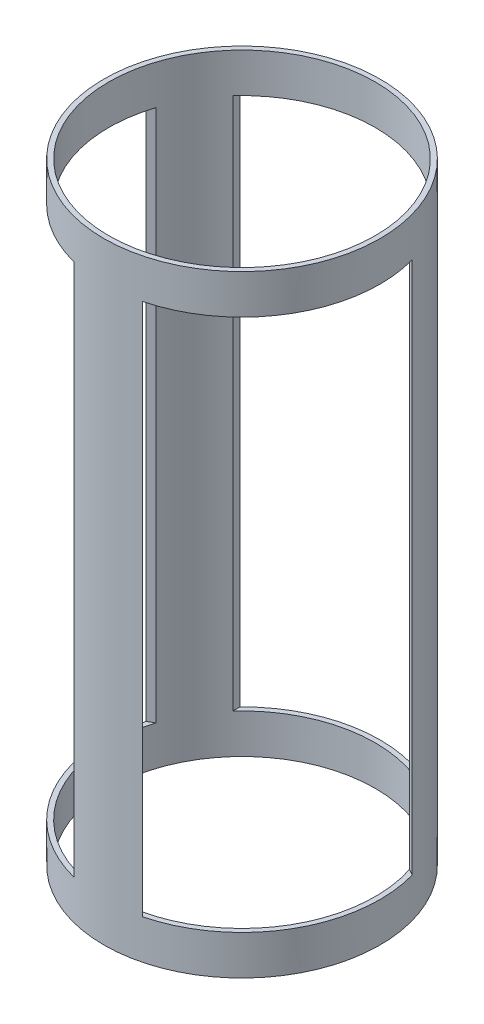
ISO-10303-21;
HEADER;
FILE_DESCRIPTION(('STEP AP214'),'2;1');
FILE_NAME('part.step','',(''),(''),'','','');
FILE_SCHEMA(('AUTOMOTIVE_DESIGN { 1 0 10303 214 1 1 1 1 }'));
ENDSEC;
DATA;
#1=APPLICATION_CONTEXT('core data for automotive mechanical design processes');
#2=APPLICATION_PROTOCOL_DEFINITION('international standard','automotive_design',2000,#1);
#3=PRODUCT_CONTEXT('',#1,'mechanical');
#4=PRODUCT('Part','Part','',(#3));
#5=PRODUCT_RELATED_PRODUCT_CATEGORY('part','',(#4));
#6=PRODUCT_DEFINITION_FORMATION('','',#4);
#7=PRODUCT_DEFINITION_CONTEXT('part definition',#1,'design');
#8=PRODUCT_DEFINITION('design','',#6,#7);
#9=PRODUCT_DEFINITION_SHAPE('','',#8);
#10=(LENGTH_UNIT() NAMED_UNIT(*) SI_UNIT(.MILLI.,.METRE.));
#11=(NAMED_UNIT(*) PLANE_ANGLE_UNIT() SI_UNIT($,.RADIAN.));
#12=(NAMED_UNIT(*) SI_UNIT($,.STERADIAN.) SOLID_ANGLE_UNIT());
#13=UNCERTAINTY_MEASURE_WITH_UNIT(LENGTH_MEASURE(1.E-05),#10,'distance_accuracy_value','');
#14=(GEOMETRIC_REPRESENTATION_CONTEXT(3) GLOBAL_UNCERTAINTY_ASSIGNED_CONTEXT((#13)) GLOBAL_UNIT_ASSIGNED_CONTEXT((#10,
#11,#12)) REPRESENTATION_CONTEXT('',''));
#15=CARTESIAN_POINT('',(0.,0.,0.));
#16=DIRECTION('',(0.,0.,1.));
#17=DIRECTION('',(1.,0.,0.));
#18=AXIS2_PLACEMENT_3D('',#15,#16,#17);
#19=CARTESIAN_POINT('',(0.,196.85,0.));
#20=DIRECTION('',(0.,1.,0.));
#21=DIRECTION('',(0.,0.,1.));
#22=AXIS2_PLACEMENT_3D('',#19,#20,#21);
#23=PLANE('',#22);
#24=CARTESIAN_POINT('',(0.,196.85,0.));
#25=DIRECTION('',(0.,1.,0.));
#26=DIRECTION('',(0.,0.,1.));
#27=AXIS2_PLACEMENT_3D('',#24,#25,#26);
#28=CIRCLE('',#27,88.9);
#29=CARTESIAN_POINT('',(0.,196.85,88.9));
#30=VERTEX_POINT('',#29);
#31=EDGE_CURVE('E258',#30,#30,#28,.T.);
#32=ORIENTED_EDGE('',*,*,#31,.T.);
#33=EDGE_LOOP('',(#32));
#34=FACE_BOUND('',#33,.T.);
#35=CARTESIAN_POINT('',(0.,196.85,0.));
#36=DIRECTION('',(0.,1.,0.));
#37=DIRECTION('',(0.,0.,1.));
#38=AXIS2_PLACEMENT_3D('',#35,#36,#37);
#39=CIRCLE('',#38,85.725);
#40=CARTESIAN_POINT('',(0.,196.85,85.725));
#41=VERTEX_POINT('',#40);
#42=EDGE_CURVE('E250',#41,#41,#39,.T.);
#43=ORIENTED_EDGE('',*,*,#42,.F.);
#44=EDGE_LOOP('',(#43));
#45=FACE_BOUND('',#44,.T.);
#46=ADVANCED_FACE('F39',(#34,#45),#23,.T.);
#47=CARTESIAN_POINT('',(0.,-196.85,0.));
#48=DIRECTION('',(0.,1.,0.));
#49=DIRECTION('',(0.,0.,1.));
#50=AXIS2_PLACEMENT_3D('',#47,#48,#49);
#51=PLANE('',#50);
#52=CARTESIAN_POINT('',(0.,-196.85,0.));
#53=DIRECTION('',(0.,1.,0.));
#54=DIRECTION('',(0.,0.,1.));
#55=AXIS2_PLACEMENT_3D('',#52,#53,#54);
#56=CIRCLE('',#55,88.9);
#57=CARTESIAN_POINT('',(0.,-196.85,88.9));
#58=VERTEX_POINT('',#57);
#59=EDGE_CURVE('E254',#58,#58,#56,.T.);
#60=ORIENTED_EDGE('',*,*,#59,.F.);
#61=EDGE_LOOP('',(#60));
#62=FACE_BOUND('',#61,.T.);
#63=CARTESIAN_POINT('',(0.,-196.85,0.));
#64=DIRECTION('',(0.,1.,0.));
#65=DIRECTION('',(0.,0.,1.));
#66=AXIS2_PLACEMENT_3D('',#63,#64,#65);
#67=CIRCLE('',#66,85.725);
#68=CARTESIAN_POINT('',(0.,-196.85,85.725));
#69=VERTEX_POINT('',#68);
#70=EDGE_CURVE('E223',#69,#69,#67,.T.);
#71=ORIENTED_EDGE('',*,*,#70,.T.);
#72=EDGE_LOOP('',(#71));
#73=FACE_BOUND('',#72,.T.);
#74=ADVANCED_FACE('F293',(#62,#73),#51,.F.);
#75=CARTESIAN_POINT('',(0.,196.85,0.));
#76=DIRECTION('',(0.,-1.,0.));
#77=DIRECTION('',(0.,0.,-1.));
#78=AXIS2_PLACEMENT_3D('',#75,#76,#77);
#79=CYLINDRICAL_SURFACE('',#78,88.9);
#80=CARTESIAN_POINT('',(0.,-171.45,0.));
#81=DIRECTION('',(0.,-1.,0.));
#82=DIRECTION('',(0.866025403784436,0.,0.500000000000004));
#83=AXIS2_PLACEMENT_3D('',#80,#81,#82);
#84=CIRCLE('',#83,88.9);
#85=CARTESIAN_POINT('',(22.1315367264145,-171.45,86.1011328736583));
#86=VERTEX_POINT('',#85);
#87=CARTESIAN_POINT('',(85.631536726415,-171.45,-23.8840934069651));
#88=VERTEX_POINT('',#87);
#89=EDGE_CURVE('E169',#86,#88,#84,.F.);
#90=ORIENTED_EDGE('',*,*,#89,.F.);
#91=DIRECTION('',(0.,-1.,0.));
#92=VECTOR('',#91,1.);
#93=CARTESIAN_POINT('',(22.1315367264145,196.85,86.1011328736583));
#94=LINE('',#93,#92);
#95=CARTESIAN_POINT('',(22.1315367264145,171.45,86.1011328736583));
#96=VERTEX_POINT('',#95);
#97=EDGE_CURVE('E176',#96,#86,#94,.T.);
#98=ORIENTED_EDGE('',*,*,#97,.F.);
#99=CARTESIAN_POINT('',(0.,171.45,0.));
#100=DIRECTION('',(0.,1.,0.));
#101=DIRECTION('',(-0.866025403784436,0.,-0.500000000000004));
#102=AXIS2_PLACEMENT_3D('',#99,#100,#101);
#103=CIRCLE('',#102,88.9);
#104=CARTESIAN_POINT('',(85.631536726415,171.45,-23.8840934069651));
#105=VERTEX_POINT('',#104);
#106=EDGE_CURVE('E141',#105,#96,#103,.F.);
#107=ORIENTED_EDGE('',*,*,#106,.F.);
#108=DIRECTION('',(0.,-1.,0.));
#109=VECTOR('',#108,1.);
#110=CARTESIAN_POINT('',(85.631536726415,196.85,-23.8840934069651));
#111=LINE('',#110,#109);
#112=EDGE_CURVE('E55',#88,#105,#111,.F.);
#113=ORIENTED_EDGE('',*,*,#112,.F.);
#114=EDGE_LOOP('',(#90,#98,#107,#113));
#115=FACE_BOUND('',#114,.T.);
#116=CARTESIAN_POINT('',(0.,-171.45,0.));
#117=DIRECTION('',(0.,-1.,0.));
#118=DIRECTION('',(-0.866025403784443,0.,0.499999999999992));
#119=AXIS2_PLACEMENT_3D('',#116,#117,#118);
#120=CIRCLE('',#119,88.9);
#121=CARTESIAN_POINT('',(-85.6315367264147,-171.45,-23.8840934069663));
#122=VERTEX_POINT('',#121);
#123=CARTESIAN_POINT('',(-22.1315367264157,-171.45,86.101132873658));
#124=VERTEX_POINT('',#123);
#125=EDGE_CURVE('E210',#122,#124,#120,.F.);
#126=ORIENTED_EDGE('',*,*,#125,.F.);
#127=DIRECTION('',(0.,-1.,0.));
#128=VECTOR('',#127,1.);
#129=CARTESIAN_POINT('',(-85.6315367264147,196.85,-23.8840934069663));
#130=LINE('',#129,#128);
#131=CARTESIAN_POINT('',(-85.6315367264147,171.45,-23.8840934069663));
#132=VERTEX_POINT('',#131);
#133=EDGE_CURVE('E142',#132,#122,#130,.T.);
#134=ORIENTED_EDGE('',*,*,#133,.F.);
#135=CARTESIAN_POINT('',(0.,171.45,0.));
#136=DIRECTION('',(0.,1.,0.));
#137=DIRECTION('',(0.866025403784443,0.,-0.499999999999992));
#138=AXIS2_PLACEMENT_3D('',#135,#136,#137);
#139=CIRCLE('',#138,88.9);
#140=CARTESIAN_POINT('',(-22.1315367264157,171.45,86.101132873658));
#141=VERTEX_POINT('',#140);
#142=EDGE_CURVE('E184',#141,#132,#139,.F.);
#143=ORIENTED_EDGE('',*,*,#142,.F.);
#144=DIRECTION('',(0.,-1.,0.));
#145=VECTOR('',#144,1.);
#146=CARTESIAN_POINT('',(-22.1315367264157,196.85,86.101132873658));
#147=LINE('',#146,#145);
#148=EDGE_CURVE('E63',#124,#141,#147,.F.);
#149=ORIENTED_EDGE('',*,*,#148,.F.);
#150=EDGE_LOOP('',(#126,#134,#143,#149));
#151=FACE_BOUND('',#150,.T.);
#152=CARTESIAN_POINT('',(0.,-171.45,0.));
#153=DIRECTION('',(0.,-1.,0.));
#154=DIRECTION('',(0.,0.,-1.));
#155=AXIS2_PLACEMENT_3D('',#152,#153,#154);
#156=CIRCLE('',#155,88.9);
#157=CARTESIAN_POINT('',(63.5,-171.45,-62.2170394666927));
#158=VERTEX_POINT('',#157);
#159=CARTESIAN_POINT('',(-63.5,-171.45,-62.2170394666927));
#160=VERTEX_POINT('',#159);
#161=EDGE_CURVE('E224',#158,#160,#156,.F.);
#162=ORIENTED_EDGE('',*,*,#161,.F.);
#163=DIRECTION('',(0.,-1.,0.));
#164=VECTOR('',#163,1.);
#165=CARTESIAN_POINT('',(63.5,196.85,-62.2170394666927));
#166=LINE('',#165,#164);
#167=CARTESIAN_POINT('',(63.5,171.45,-62.2170394666927));
#168=VERTEX_POINT('',#167);
#169=EDGE_CURVE('E228',#168,#158,#166,.T.);
#170=ORIENTED_EDGE('',*,*,#169,.F.);
#171=CARTESIAN_POINT('',(0.,171.45,0.));
#172=DIRECTION('',(0.,1.,0.));
#173=DIRECTION('',(0.,0.,1.));
#174=AXIS2_PLACEMENT_3D('',#171,#172,#173);
#175=CIRCLE('',#174,88.9);
#176=CARTESIAN_POINT('',(-63.5,171.45,-62.2170394666927));
#177=VERTEX_POINT('',#176);
#178=EDGE_CURVE('E232',#177,#168,#175,.F.);
#179=ORIENTED_EDGE('',*,*,#178,.F.);
#180=DIRECTION('',(0.,-1.,0.));
#181=VECTOR('',#180,1.);
#182=CARTESIAN_POINT('',(-63.5,196.85,-62.2170394666927));
#183=LINE('',#182,#181);
#184=EDGE_CURVE('E220',#160,#177,#183,.F.);
#185=ORIENTED_EDGE('',*,*,#184,.F.);
#186=EDGE_LOOP('',(#162,#170,#179,#185));
#187=FACE_BOUND('',#186,.T.);
#188=ORIENTED_EDGE('',*,*,#31,.F.);
#189=EDGE_LOOP('',(#188));
#190=FACE_BOUND('',#189,.T.);
#191=ORIENTED_EDGE('',*,*,#59,.T.);
#192=EDGE_LOOP('',(#191));
#193=FACE_BOUND('',#192,.T.);
#194=ADVANCED_FACE('F41',(#115,#151,#187,#190,#193),#79,.T.);
#195=CARTESIAN_POINT('',(0.,196.85,0.));
#196=DIRECTION('',(0.,-1.,0.));
#197=DIRECTION('',(0.,0.,-1.));
#198=AXIS2_PLACEMENT_3D('',#195,#196,#197);
#199=CYLINDRICAL_SURFACE('',#198,85.725);
#200=DIRECTION('',(0.,-1.,0.));
#201=VECTOR('',#200,1.);
#202=CARTESIAN_POINT('',(18.1237828798855,196.85,83.787255111519));
#203=LINE('',#202,#201);
#204=CARTESIAN_POINT('',(18.1237828798855,-171.45,83.787255111519));
#205=VERTEX_POINT('',#204);
#206=CARTESIAN_POINT('',(18.1237828798855,171.45,83.787255111519));
#207=VERTEX_POINT('',#206);
#208=EDGE_CURVE('E173',#205,#207,#203,.F.);
#209=ORIENTED_EDGE('',*,*,#208,.F.);
#210=CARTESIAN_POINT('',(0.,-171.45,0.));
#211=DIRECTION('',(0.,-1.,0.));
#212=DIRECTION('',(0.866025403784436,0.,0.500000000000004));
#213=AXIS2_PLACEMENT_3D('',#210,#211,#212);
#214=CIRCLE('',#213,85.725);
#215=CARTESIAN_POINT('',(81.623782879886,-171.45,-26.1979711691044));
#216=VERTEX_POINT('',#215);
#217=EDGE_CURVE('E152',#216,#205,#214,.T.);
#218=ORIENTED_EDGE('',*,*,#217,.F.);
#219=DIRECTION('',(0.,-1.,0.));
#220=VECTOR('',#219,1.);
#221=CARTESIAN_POINT('',(81.623782879886,196.85,-26.1979711691044));
#222=LINE('',#221,#220);
#223=CARTESIAN_POINT('',(81.623782879886,171.45,-26.1979711691044));
#224=VERTEX_POINT('',#223);
#225=EDGE_CURVE('E145',#224,#216,#222,.T.);
#226=ORIENTED_EDGE('',*,*,#225,.F.);
#227=CARTESIAN_POINT('',(0.,171.45,0.));
#228=DIRECTION('',(0.,1.,0.));
#229=DIRECTION('',(-0.866025403784436,0.,-0.500000000000004));
#230=AXIS2_PLACEMENT_3D('',#227,#228,#229);
#231=CIRCLE('',#230,85.725);
#232=EDGE_CURVE('E131',#207,#224,#231,.T.);
#233=ORIENTED_EDGE('',*,*,#232,.F.);
#234=EDGE_LOOP('',(#209,#218,#226,#233));
#235=FACE_BOUND('',#234,.T.);
#236=DIRECTION('',(0.,-1.,0.));
#237=VECTOR('',#236,1.);
#238=CARTESIAN_POINT('',(-81.6237828798856,196.85,-26.1979711691055));
#239=LINE('',#238,#237);
#240=CARTESIAN_POINT('',(-81.6237828798856,-171.45,-26.1979711691055));
#241=VERTEX_POINT('',#240);
#242=CARTESIAN_POINT('',(-81.6237828798857,171.45,-26.1979711691055));
#243=VERTEX_POINT('',#242);
#244=EDGE_CURVE('E214',#241,#243,#239,.F.);
#245=ORIENTED_EDGE('',*,*,#244,.F.);
#246=CARTESIAN_POINT('',(0.,-171.45,0.));
#247=DIRECTION('',(0.,-1.,0.));
#248=DIRECTION('',(-0.866025403784443,0.,0.499999999999992));
#249=AXIS2_PLACEMENT_3D('',#246,#247,#248);
#250=CIRCLE('',#249,85.725);
#251=CARTESIAN_POINT('',(-18.1237828798867,-171.45,83.7872551115187));
#252=VERTEX_POINT('',#251);
#253=EDGE_CURVE('E203',#252,#241,#250,.T.);
#254=ORIENTED_EDGE('',*,*,#253,.F.);
#255=DIRECTION('',(0.,-1.,0.));
#256=VECTOR('',#255,1.);
#257=CARTESIAN_POINT('',(-18.1237828798867,196.85,83.7872551115187));
#258=LINE('',#257,#256);
#259=CARTESIAN_POINT('',(-18.1237828798867,171.45,83.7872551115187));
#260=VERTEX_POINT('',#259);
#261=EDGE_CURVE('E194',#260,#252,#258,.T.);
#262=ORIENTED_EDGE('',*,*,#261,.F.);
#263=CARTESIAN_POINT('',(0.,171.45,0.));
#264=DIRECTION('',(0.,1.,0.));
#265=DIRECTION('',(0.866025403784443,0.,-0.499999999999992));
#266=AXIS2_PLACEMENT_3D('',#263,#264,#265);
#267=CIRCLE('',#266,85.725);
#268=EDGE_CURVE('E181',#243,#260,#267,.T.);
#269=ORIENTED_EDGE('',*,*,#268,.F.);
#270=EDGE_LOOP('',(#245,#254,#262,#269));
#271=FACE_BOUND('',#270,.T.);
#272=DIRECTION('',(0.,-1.,0.));
#273=VECTOR('',#272,1.);
#274=CARTESIAN_POINT('',(63.5,196.85,-57.5892839424141));
#275=LINE('',#274,#273);
#276=CARTESIAN_POINT('',(63.5,-171.45,-57.5892839424141));
#277=VERTEX_POINT('',#276);
#278=CARTESIAN_POINT('',(63.5,171.45,-57.5892839424141));
#279=VERTEX_POINT('',#278);
#280=EDGE_CURVE('E11',#277,#279,#275,.F.);
#281=ORIENTED_EDGE('',*,*,#280,.F.);
#282=CARTESIAN_POINT('',(0.,-171.45,0.));
#283=DIRECTION('',(0.,-1.,0.));
#284=DIRECTION('',(0.,0.,-1.));
#285=AXIS2_PLACEMENT_3D('',#282,#283,#284);
#286=CIRCLE('',#285,85.725);
#287=CARTESIAN_POINT('',(-63.5,-171.45,-57.5892839424141));
#288=VERTEX_POINT('',#287);
#289=EDGE_CURVE('E48',#288,#277,#286,.T.);
#290=ORIENTED_EDGE('',*,*,#289,.F.);
#291=DIRECTION('',(0.,-1.,0.));
#292=VECTOR('',#291,1.);
#293=CARTESIAN_POINT('',(-63.5,196.85,-57.5892839424141));
#294=LINE('',#293,#292);
#295=CARTESIAN_POINT('',(-63.5,171.45,-57.5892839424141));
#296=VERTEX_POINT('',#295);
#297=EDGE_CURVE('E268',#296,#288,#294,.T.);
#298=ORIENTED_EDGE('',*,*,#297,.F.);
#299=CARTESIAN_POINT('',(0.,171.45,0.));
#300=DIRECTION('',(0.,1.,0.));
#301=DIRECTION('',(0.,0.,1.));
#302=AXIS2_PLACEMENT_3D('',#299,#300,#301);
#303=CIRCLE('',#302,85.725);
#304=EDGE_CURVE('E262',#279,#296,#303,.T.);
#305=ORIENTED_EDGE('',*,*,#304,.F.);
#306=EDGE_LOOP('',(#281,#290,#298,#305));
#307=FACE_BOUND('',#306,.T.);
#308=ORIENTED_EDGE('',*,*,#42,.T.);
#309=EDGE_LOOP('',(#308));
#310=FACE_BOUND('',#309,.T.);
#311=ORIENTED_EDGE('',*,*,#70,.F.);
#312=EDGE_LOOP('',(#311));
#313=FACE_BOUND('',#312,.T.);
#314=ADVANCED_FACE('F150',(#235,#271,#307,#310,#313),#199,.F.);
#315=CARTESIAN_POINT('',(63.5,-171.45,-88.901));
#316=DIRECTION('',(1.,0.,0.));
#317=DIRECTION('',(0.,0.,-1.));
#318=AXIS2_PLACEMENT_3D('',#315,#316,#317);
#319=PLANE('',#318);
#320=ORIENTED_EDGE('',*,*,#280,.T.);
#321=DIRECTION('',(0.,0.,1.));
#322=VECTOR('',#321,1.);
#323=CARTESIAN_POINT('',(63.5,171.45,-88.901));
#324=LINE('',#323,#322);
#325=EDGE_CURVE('E180',#168,#279,#324,.T.);
#326=ORIENTED_EDGE('',*,*,#325,.F.);
#327=ORIENTED_EDGE('',*,*,#169,.T.);
#328=DIRECTION('',(0.,0.,1.));
#329=VECTOR('',#328,1.);
#330=CARTESIAN_POINT('',(63.5,-171.45,-88.901));
#331=LINE('',#330,#329);
#332=EDGE_CURVE('E237',#158,#277,#331,.T.);
#333=ORIENTED_EDGE('',*,*,#332,.T.);
#334=EDGE_LOOP('',(#320,#326,#327,#333));
#335=FACE_BOUND('',#334,.T.);
#336=ADVANCED_FACE('F278',(#335),#319,.F.);
#337=CARTESIAN_POINT('',(-63.5,-171.45,-88.901));
#338=DIRECTION('',(0.,-1.,0.));
#339=DIRECTION('',(0.,0.,-1.));
#340=AXIS2_PLACEMENT_3D('',#337,#338,#339);
#341=PLANE('',#340);
#342=ORIENTED_EDGE('',*,*,#289,.T.);
#343=ORIENTED_EDGE('',*,*,#332,.F.);
#344=ORIENTED_EDGE('',*,*,#161,.T.);
#345=DIRECTION('',(0.,0.,1.));
#346=VECTOR('',#345,1.);
#347=CARTESIAN_POINT('',(-63.5,-171.45,-88.901));
#348=LINE('',#347,#346);
#349=EDGE_CURVE('E241',#160,#288,#348,.T.);
#350=ORIENTED_EDGE('',*,*,#349,.T.);
#351=EDGE_LOOP('',(#342,#343,#344,#350));
#352=FACE_BOUND('',#351,.T.);
#353=ADVANCED_FACE('F273',(#352),#341,.F.);
#354=CARTESIAN_POINT('',(-63.5,-171.45,-88.901));
#355=DIRECTION('',(-1.,0.,0.));
#356=DIRECTION('',(0.,0.,1.));
#357=AXIS2_PLACEMENT_3D('',#354,#355,#356);
#358=PLANE('',#357);
#359=ORIENTED_EDGE('',*,*,#297,.T.);
#360=ORIENTED_EDGE('',*,*,#349,.F.);
#361=ORIENTED_EDGE('',*,*,#184,.T.);
#362=DIRECTION('',(0.,0.,1.));
#363=VECTOR('',#362,1.);
#364=CARTESIAN_POINT('',(-63.5,171.45,-88.901));
#365=LINE('',#364,#363);
#366=EDGE_CURVE('E236',#177,#296,#365,.T.);
#367=ORIENTED_EDGE('',*,*,#366,.T.);
#368=EDGE_LOOP('',(#359,#360,#361,#367));
#369=FACE_BOUND('',#368,.T.);
#370=ADVANCED_FACE('F288',(#369),#358,.F.);
#371=CARTESIAN_POINT('',(-63.5,171.45,-88.901));
#372=DIRECTION('',(0.,1.,0.));
#373=DIRECTION('',(0.,0.,1.));
#374=AXIS2_PLACEMENT_3D('',#371,#372,#373);
#375=PLANE('',#374);
#376=ORIENTED_EDGE('',*,*,#304,.T.);
#377=ORIENTED_EDGE('',*,*,#366,.F.);
#378=ORIENTED_EDGE('',*,*,#178,.T.);
#379=ORIENTED_EDGE('',*,*,#325,.T.);
#380=EDGE_LOOP('',(#376,#377,#378,#379));
#381=FACE_BOUND('',#380,.T.);
#382=ADVANCED_FACE('F285',(#381),#375,.F.);
#383=CARTESIAN_POINT('',(-108.74052442184,-171.45,-10.5421131403129));
#384=DIRECTION('',(-0.499999999999992,0.,-0.866025403784443));
#385=DIRECTION('',(-0.866025403784443,0.,0.499999999999992));
#386=AXIS2_PLACEMENT_3D('',#383,#384,#385);
#387=PLANE('',#386);
#388=ORIENTED_EDGE('',*,*,#244,.T.);
#389=DIRECTION('',(0.866025403784443,0.,-0.499999999999992));
#390=VECTOR('',#389,1.);
#391=CARTESIAN_POINT('',(-108.74052442184,171.45,-10.5421131403129));
#392=LINE('',#391,#390);
#393=EDGE_CURVE('E190',#132,#243,#392,.T.);
#394=ORIENTED_EDGE('',*,*,#393,.F.);
#395=ORIENTED_EDGE('',*,*,#133,.T.);
#396=DIRECTION('',(0.866025403784443,0.,-0.499999999999992));
#397=VECTOR('',#396,1.);
#398=CARTESIAN_POINT('',(-108.74052442184,-171.45,-10.5421131403129));
#399=LINE('',#398,#397);
#400=EDGE_CURVE('E206',#122,#241,#399,.T.);
#401=ORIENTED_EDGE('',*,*,#400,.T.);
#402=EDGE_LOOP('',(#388,#394,#395,#401));
#403=FACE_BOUND('',#402,.T.);
#404=ADVANCED_FACE('F340',(#403),#387,.F.);
#405=CARTESIAN_POINT('',(-45.2405244218413,-171.45,99.4431131403114));
#406=DIRECTION('',(0.,-1.,0.));
#407=DIRECTION('',(-0.866025403784443,0.,0.499999999999992));
#408=AXIS2_PLACEMENT_3D('',#405,#406,#407);
#409=PLANE('',#408);
#410=ORIENTED_EDGE('',*,*,#253,.T.);
#411=ORIENTED_EDGE('',*,*,#400,.F.);
#412=ORIENTED_EDGE('',*,*,#125,.T.);
#413=DIRECTION('',(0.866025403784443,0.,-0.499999999999992));
#414=VECTOR('',#413,1.);
#415=CARTESIAN_POINT('',(-45.2405244218413,-171.45,99.4431131403114));
#416=LINE('',#415,#414);
#417=EDGE_CURVE('E197',#124,#252,#416,.T.);
#418=ORIENTED_EDGE('',*,*,#417,.T.);
#419=EDGE_LOOP('',(#410,#411,#412,#418));
#420=FACE_BOUND('',#419,.T.);
#421=ADVANCED_FACE('F345',(#420),#409,.F.);
#422=CARTESIAN_POINT('',(-45.2405244218413,-171.45,99.4431131403114));
#423=DIRECTION('',(0.499999999999992,0.,0.866025403784443));
#424=DIRECTION('',(0.866025403784443,0.,-0.499999999999992));
#425=AXIS2_PLACEMENT_3D('',#422,#423,#424);
#426=PLANE('',#425);
#427=ORIENTED_EDGE('',*,*,#261,.T.);
#428=ORIENTED_EDGE('',*,*,#417,.F.);
#429=ORIENTED_EDGE('',*,*,#148,.T.);
#430=DIRECTION('',(0.866025403784443,0.,-0.499999999999992));
#431=VECTOR('',#430,1.);
#432=CARTESIAN_POINT('',(-45.2405244218413,171.45,99.4431131403114));
#433=LINE('',#432,#431);
#434=EDGE_CURVE('E187',#141,#260,#433,.T.);
#435=ORIENTED_EDGE('',*,*,#434,.T.);
#436=EDGE_LOOP('',(#427,#428,#429,#435));
#437=FACE_BOUND('',#436,.T.);
#438=ADVANCED_FACE('F355',(#437),#426,.F.);
#439=CARTESIAN_POINT('',(-45.2405244218413,171.45,99.4431131403114));
#440=DIRECTION('',(0.,1.,0.));
#441=DIRECTION('',(0.866025403784443,0.,-0.499999999999992));
#442=AXIS2_PLACEMENT_3D('',#439,#440,#441);
#443=PLANE('',#442);
#444=ORIENTED_EDGE('',*,*,#268,.T.);
#445=ORIENTED_EDGE('',*,*,#434,.F.);
#446=ORIENTED_EDGE('',*,*,#142,.T.);
#447=ORIENTED_EDGE('',*,*,#393,.T.);
#448=EDGE_LOOP('',(#444,#445,#446,#447));
#449=FACE_BOUND('',#448,.T.);
#450=ADVANCED_FACE('F365',(#449),#443,.F.);
#451=CARTESIAN_POINT('',(45.2405244218399,-171.45,99.4431131403121));
#452=DIRECTION('',(-0.500000000000004,0.,0.866025403784436));
#453=DIRECTION('',(0.866025403784436,0.,0.500000000000004));
#454=AXIS2_PLACEMENT_3D('',#451,#452,#453);
#455=PLANE('',#454);
#456=ORIENTED_EDGE('',*,*,#208,.T.);
#457=DIRECTION('',(-0.866025403784436,0.,-0.500000000000004));
#458=VECTOR('',#457,1.);
#459=CARTESIAN_POINT('',(45.2405244218399,171.45,99.4431131403121));
#460=LINE('',#459,#458);
#461=EDGE_CURVE('E136',#96,#207,#460,.T.);
#462=ORIENTED_EDGE('',*,*,#461,.F.);
#463=ORIENTED_EDGE('',*,*,#97,.T.);
#464=DIRECTION('',(-0.866025403784436,0.,-0.500000000000004));
#465=VECTOR('',#464,1.);
#466=CARTESIAN_POINT('',(45.2405244218399,-171.45,99.4431131403121));
#467=LINE('',#466,#465);
#468=EDGE_CURVE('E165',#86,#205,#467,.T.);
#469=ORIENTED_EDGE('',*,*,#468,.T.);
#470=EDGE_LOOP('',(#456,#462,#463,#469));
#471=FACE_BOUND('',#470,.T.);
#472=ADVANCED_FACE('F374',(#471),#455,.F.);
#473=CARTESIAN_POINT('',(108.74052442184,-171.45,-10.5421131403114));
#474=DIRECTION('',(0.,-1.,0.));
#475=DIRECTION('',(0.866025403784436,0.,0.500000000000004));
#476=AXIS2_PLACEMENT_3D('',#473,#474,#475);
#477=PLANE('',#476);
#478=ORIENTED_EDGE('',*,*,#217,.T.);
#479=ORIENTED_EDGE('',*,*,#468,.F.);
#480=ORIENTED_EDGE('',*,*,#89,.T.);
#481=DIRECTION('',(-0.866025403784436,0.,-0.500000000000004));
#482=VECTOR('',#481,1.);
#483=CARTESIAN_POINT('',(108.74052442184,-171.45,-10.5421131403114));
#484=LINE('',#483,#482);
#485=EDGE_CURVE('E154',#88,#216,#484,.T.);
#486=ORIENTED_EDGE('',*,*,#485,.T.);
#487=EDGE_LOOP('',(#478,#479,#480,#486));
#488=FACE_BOUND('',#487,.T.);
#489=ADVANCED_FACE('F384',(#488),#477,.F.);
#490=CARTESIAN_POINT('',(108.74052442184,-171.45,-10.5421131403114));
#491=DIRECTION('',(0.500000000000004,0.,-0.866025403784436));
#492=DIRECTION('',(-0.866025403784436,0.,-0.500000000000004));
#493=AXIS2_PLACEMENT_3D('',#490,#491,#492);
#494=PLANE('',#493);
#495=ORIENTED_EDGE('',*,*,#225,.T.);
#496=ORIENTED_EDGE('',*,*,#485,.F.);
#497=ORIENTED_EDGE('',*,*,#112,.T.);
#498=DIRECTION('',(-0.866025403784436,0.,-0.500000000000004));
#499=VECTOR('',#498,1.);
#500=CARTESIAN_POINT('',(108.74052442184,171.45,-10.5421131403114));
#501=LINE('',#500,#499);
#502=EDGE_CURVE('E133',#105,#224,#501,.T.);
#503=ORIENTED_EDGE('',*,*,#502,.T.);
#504=EDGE_LOOP('',(#495,#496,#497,#503));
#505=FACE_BOUND('',#504,.T.);
#506=ADVANCED_FACE('F144',(#505),#494,.F.);
#507=CARTESIAN_POINT('',(108.74052442184,171.45,-10.5421131403114));
#508=DIRECTION('',(0.,1.,0.));
#509=DIRECTION('',(-0.866025403784436,0.,-0.500000000000004));
#510=AXIS2_PLACEMENT_3D('',#507,#508,#509);
#511=PLANE('',#510);
#512=ORIENTED_EDGE('',*,*,#232,.T.);
#513=ORIENTED_EDGE('',*,*,#502,.F.);
#514=ORIENTED_EDGE('',*,*,#106,.T.);
#515=ORIENTED_EDGE('',*,*,#461,.T.);
#516=EDGE_LOOP('',(#512,#513,#514,#515));
#517=FACE_BOUND('',#516,.T.);
#518=ADVANCED_FACE('F132',(#517),#511,.F.);
#519=CLOSED_SHELL('',(#46,#74,#194,#314,#336,#353,#370,#382,#404,#421,#438,#450,#472,#489,#506,#518));
#520=MANIFOLD_SOLID_BREP('B2',#519);
#521=ADVANCED_BREP_SHAPE_REPRESENTATION('',(#18,#520),#14);
#522=SHAPE_DEFINITION_REPRESENTATION(#9,#521);
ENDSEC;
END-ISO-10303-21;
